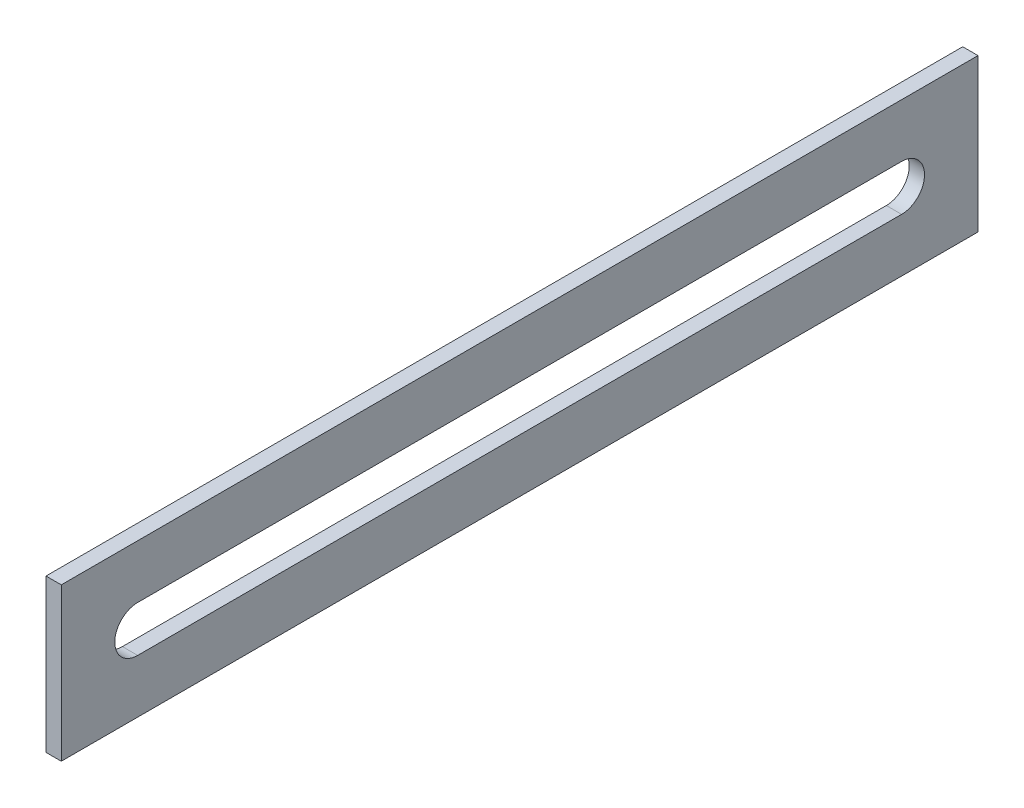
ISO-10303-21;
HEADER;
FILE_DESCRIPTION(('STEP AP214'),'2;1');
FILE_NAME('part.step','',(''),(''),'','','');
FILE_SCHEMA(('AUTOMOTIVE_DESIGN { 1 0 10303 214 1 1 1 1 }'));
ENDSEC;
DATA;
#1=APPLICATION_CONTEXT('core data for automotive mechanical design processes');
#2=APPLICATION_PROTOCOL_DEFINITION('international standard','automotive_design',2000,#1);
#3=PRODUCT_CONTEXT('',#1,'mechanical');
#4=PRODUCT('Part','Part','',(#3));
#5=PRODUCT_RELATED_PRODUCT_CATEGORY('part','',(#4));
#6=PRODUCT_DEFINITION_FORMATION('','',#4);
#7=PRODUCT_DEFINITION_CONTEXT('part definition',#1,'design');
#8=PRODUCT_DEFINITION('design','',#6,#7);
#9=PRODUCT_DEFINITION_SHAPE('','',#8);
#10=(LENGTH_UNIT() NAMED_UNIT(*) SI_UNIT(.MILLI.,.METRE.));
#11=(NAMED_UNIT(*) PLANE_ANGLE_UNIT() SI_UNIT($,.RADIAN.));
#12=(NAMED_UNIT(*) SI_UNIT($,.STERADIAN.) SOLID_ANGLE_UNIT());
#13=UNCERTAINTY_MEASURE_WITH_UNIT(LENGTH_MEASURE(1.E-05),#10,'distance_accuracy_value','');
#14=(GEOMETRIC_REPRESENTATION_CONTEXT(3) GLOBAL_UNCERTAINTY_ASSIGNED_CONTEXT((#13)) GLOBAL_UNIT_ASSIGNED_CONTEXT((#10,
#11,#12)) REPRESENTATION_CONTEXT('',''));
#15=CARTESIAN_POINT('',(0.,0.,0.));
#16=DIRECTION('',(0.,0.,1.));
#17=DIRECTION('',(1.,0.,0.));
#18=AXIS2_PLACEMENT_3D('',#15,#16,#17);
#19=CARTESIAN_POINT('',(1.,0.,0.));
#20=DIRECTION('',(1.,0.,0.));
#21=DIRECTION('',(0.,0.,-1.));
#22=AXIS2_PLACEMENT_3D('',#19,#20,#21);
#23=PLANE('',#22);
#24=DIRECTION('',(0.,-1.,0.));
#25=VECTOR('',#24,1.);
#26=CARTESIAN_POINT('',(1.,9.62195212296734,1.56603773584906));
#27=LINE('',#26,#25);
#28=CARTESIAN_POINT('',(1.,9.62195212296734,1.56603773584906));
#29=VERTEX_POINT('',#28);
#30=CARTESIAN_POINT('',(1.,-0.378047877032661,1.56603773584906));
#31=VERTEX_POINT('',#30);
#32=EDGE_CURVE('E153',#29,#31,#27,.T.);
#33=ORIENTED_EDGE('',*,*,#32,.T.);
#34=DIRECTION('',(0.,0.,-1.));
#35=VECTOR('',#34,1.);
#36=CARTESIAN_POINT('',(1.,-0.378047877032661,1.56603773584906));
#37=LINE('',#36,#35);
#38=CARTESIAN_POINT('',(1.,-0.378047877032661,-58.4339622641509));
#39=VERTEX_POINT('',#38);
#40=EDGE_CURVE('E157',#31,#39,#37,.T.);
#41=ORIENTED_EDGE('',*,*,#40,.T.);
#42=DIRECTION('',(0.,1.,0.));
#43=VECTOR('',#42,1.);
#44=CARTESIAN_POINT('',(1.,9.62195212296734,-58.4339622641509));
#45=LINE('',#44,#43);
#46=CARTESIAN_POINT('',(1.,9.62195212296734,-58.4339622641509));
#47=VERTEX_POINT('',#46);
#48=EDGE_CURVE('E161',#39,#47,#45,.T.);
#49=ORIENTED_EDGE('',*,*,#48,.T.);
#50=DIRECTION('',(0.,0.,1.));
#51=VECTOR('',#50,1.);
#52=CARTESIAN_POINT('',(1.,9.62195212296734,1.56603773584906));
#53=LINE('',#52,#51);
#54=EDGE_CURVE('E164',#47,#29,#53,.T.);
#55=ORIENTED_EDGE('',*,*,#54,.T.);
#56=EDGE_LOOP('',(#33,#41,#49,#55));
#57=FACE_BOUND('',#56,.T.);
#58=DIRECTION('',(0.,0.,-1.));
#59=VECTOR('',#58,1.);
#60=CARTESIAN_POINT('',(1.,3.12195212296734,-3.43396226415094));
#61=LINE('',#60,#59);
#62=CARTESIAN_POINT('',(1.,3.12195212296734,-3.43396226415094));
#63=VERTEX_POINT('',#62);
#64=CARTESIAN_POINT('',(1.,3.12195212296734,-53.4339622641509));
#65=VERTEX_POINT('',#64);
#66=EDGE_CURVE('E114',#63,#65,#61,.T.);
#67=ORIENTED_EDGE('',*,*,#66,.F.);
#68=CARTESIAN_POINT('',(1.,4.62195212296734,-3.43396226415094));
#69=DIRECTION('',(1.,0.,0.));
#70=DIRECTION('',(0.,0.,1.));
#71=AXIS2_PLACEMENT_3D('',#68,#69,#70);
#72=CIRCLE('',#71,1.5);
#73=CARTESIAN_POINT('',(1.,6.12195212296734,-3.43396226415094));
#74=VERTEX_POINT('',#73);
#75=EDGE_CURVE('E105',#74,#63,#72,.T.);
#76=ORIENTED_EDGE('',*,*,#75,.F.);
#77=DIRECTION('',(0.,0.,1.));
#78=VECTOR('',#77,1.);
#79=CARTESIAN_POINT('',(1.,6.12195212296734,-3.43396226415094));
#80=LINE('',#79,#78);
#81=CARTESIAN_POINT('',(1.,6.12195212296734,-53.4339622641509));
#82=VERTEX_POINT('',#81);
#83=EDGE_CURVE('E131',#82,#74,#80,.T.);
#84=ORIENTED_EDGE('',*,*,#83,.F.);
#85=CARTESIAN_POINT('',(1.,4.62195212296734,-53.4339622641509));
#86=DIRECTION('',(1.,0.,0.));
#87=DIRECTION('',(0.,0.,1.));
#88=AXIS2_PLACEMENT_3D('',#85,#86,#87);
#89=CIRCLE('',#88,1.5);
#90=EDGE_CURVE('E127',#65,#82,#89,.T.);
#91=ORIENTED_EDGE('',*,*,#90,.F.);
#92=EDGE_LOOP('',(#67,#76,#84,#91));
#93=FACE_BOUND('',#92,.T.);
#94=ADVANCED_FACE('F39',(#57,#93),#23,.T.);
#95=CARTESIAN_POINT('',(0.,0.,0.));
#96=DIRECTION('',(1.,0.,0.));
#97=DIRECTION('',(0.,0.,-1.));
#98=AXIS2_PLACEMENT_3D('',#95,#96,#97);
#99=PLANE('',#98);
#100=DIRECTION('',(0.,-1.,0.));
#101=VECTOR('',#100,1.);
#102=CARTESIAN_POINT('',(0.,9.62195212296734,1.56603773584906));
#103=LINE('',#102,#101);
#104=CARTESIAN_POINT('',(0.,9.62195212296734,1.56603773584906));
#105=VERTEX_POINT('',#104);
#106=CARTESIAN_POINT('',(0.,-0.378047877032661,1.56603773584906));
#107=VERTEX_POINT('',#106);
#108=EDGE_CURVE('E123',#105,#107,#103,.T.);
#109=ORIENTED_EDGE('',*,*,#108,.F.);
#110=DIRECTION('',(0.,0.,1.));
#111=VECTOR('',#110,1.);
#112=CARTESIAN_POINT('',(0.,9.62195212296734,1.56603773584906));
#113=LINE('',#112,#111);
#114=CARTESIAN_POINT('',(0.,9.62195212296734,-58.4339622641509));
#115=VERTEX_POINT('',#114);
#116=EDGE_CURVE('E158',#115,#105,#113,.T.);
#117=ORIENTED_EDGE('',*,*,#116,.F.);
#118=DIRECTION('',(0.,1.,0.));
#119=VECTOR('',#118,1.);
#120=CARTESIAN_POINT('',(0.,9.62195212296734,-58.4339622641509));
#121=LINE('',#120,#119);
#122=CARTESIAN_POINT('',(0.,-0.378047877032661,-58.4339622641509));
#123=VERTEX_POINT('',#122);
#124=EDGE_CURVE('E174',#123,#115,#121,.T.);
#125=ORIENTED_EDGE('',*,*,#124,.F.);
#126=DIRECTION('',(0.,0.,-1.));
#127=VECTOR('',#126,1.);
#128=CARTESIAN_POINT('',(0.,-0.378047877032661,1.56603773584906));
#129=LINE('',#128,#127);
#130=EDGE_CURVE('E171',#107,#123,#129,.T.);
#131=ORIENTED_EDGE('',*,*,#130,.F.);
#132=EDGE_LOOP('',(#109,#117,#125,#131));
#133=FACE_BOUND('',#132,.T.);
#134=CARTESIAN_POINT('',(0.,4.62195212296734,-3.43396226415094));
#135=DIRECTION('',(1.,0.,0.));
#136=DIRECTION('',(0.,0.,1.));
#137=AXIS2_PLACEMENT_3D('',#134,#135,#136);
#138=CIRCLE('',#137,1.5);
#139=CARTESIAN_POINT('',(0.,6.12195212296734,-3.43396226415094));
#140=VERTEX_POINT('',#139);
#141=CARTESIAN_POINT('',(0.,3.12195212296734,-3.43396226415094));
#142=VERTEX_POINT('',#141);
#143=EDGE_CURVE('E63',#140,#142,#138,.T.);
#144=ORIENTED_EDGE('',*,*,#143,.T.);
#145=DIRECTION('',(0.,0.,-1.));
#146=VECTOR('',#145,1.);
#147=CARTESIAN_POINT('',(0.,3.12195212296734,-3.43396226415094));
#148=LINE('',#147,#146);
#149=CARTESIAN_POINT('',(0.,3.12195212296734,-53.4339622641509));
#150=VERTEX_POINT('',#149);
#151=EDGE_CURVE('E121',#142,#150,#148,.T.);
#152=ORIENTED_EDGE('',*,*,#151,.T.);
#153=CARTESIAN_POINT('',(0.,4.62195212296734,-53.4339622641509));
#154=DIRECTION('',(1.,0.,0.));
#155=DIRECTION('',(0.,0.,1.));
#156=AXIS2_PLACEMENT_3D('',#153,#154,#155);
#157=CIRCLE('',#156,1.5);
#158=CARTESIAN_POINT('',(0.,6.12195212296734,-53.4339622641509));
#159=VERTEX_POINT('',#158);
#160=EDGE_CURVE('E140',#150,#159,#157,.T.);
#161=ORIENTED_EDGE('',*,*,#160,.T.);
#162=DIRECTION('',(0.,0.,1.));
#163=VECTOR('',#162,1.);
#164=CARTESIAN_POINT('',(0.,6.12195212296734,-3.43396226415094));
#165=LINE('',#164,#163);
#166=EDGE_CURVE('E115',#159,#140,#165,.T.);
#167=ORIENTED_EDGE('',*,*,#166,.T.);
#168=EDGE_LOOP('',(#144,#152,#161,#167));
#169=FACE_BOUND('',#168,.T.);
#170=ADVANCED_FACE('F197',(#133,#169),#99,.F.);
#171=CARTESIAN_POINT('',(1.,9.62195212296734,1.56603773584906));
#172=DIRECTION('',(0.,0.,-1.));
#173=DIRECTION('',(0.,1.,0.));
#174=AXIS2_PLACEMENT_3D('',#171,#172,#173);
#175=PLANE('',#174);
#176=ORIENTED_EDGE('',*,*,#108,.T.);
#177=DIRECTION('',(-1.,0.,0.));
#178=VECTOR('',#177,1.);
#179=CARTESIAN_POINT('',(1.,-0.378047877032661,1.56603773584906));
#180=LINE('',#179,#178);
#181=EDGE_CURVE('E11',#31,#107,#180,.T.);
#182=ORIENTED_EDGE('',*,*,#181,.F.);
#183=ORIENTED_EDGE('',*,*,#32,.F.);
#184=DIRECTION('',(-1.,0.,0.));
#185=VECTOR('',#184,1.);
#186=CARTESIAN_POINT('',(1.,9.62195212296734,1.56603773584906));
#187=LINE('',#186,#185);
#188=EDGE_CURVE('E167',#29,#105,#187,.T.);
#189=ORIENTED_EDGE('',*,*,#188,.T.);
#190=EDGE_LOOP('',(#176,#182,#183,#189));
#191=FACE_BOUND('',#190,.T.);
#192=ADVANCED_FACE('F41',(#191),#175,.F.);
#193=CARTESIAN_POINT('',(1.,-0.378047877032661,1.56603773584906));
#194=DIRECTION('',(0.,1.,0.));
#195=DIRECTION('',(0.,0.,1.));
#196=AXIS2_PLACEMENT_3D('',#193,#194,#195);
#197=PLANE('',#196);
#198=ORIENTED_EDGE('',*,*,#130,.T.);
#199=DIRECTION('',(-1.,0.,0.));
#200=VECTOR('',#199,1.);
#201=CARTESIAN_POINT('',(1.,-0.378047877032661,-58.4339622641509));
#202=LINE('',#201,#200);
#203=EDGE_CURVE('E48',#39,#123,#202,.T.);
#204=ORIENTED_EDGE('',*,*,#203,.F.);
#205=ORIENTED_EDGE('',*,*,#40,.F.);
#206=ORIENTED_EDGE('',*,*,#181,.T.);
#207=EDGE_LOOP('',(#198,#204,#205,#206));
#208=FACE_BOUND('',#207,.T.);
#209=ADVANCED_FACE('F207',(#208),#197,.F.);
#210=CARTESIAN_POINT('',(1.,9.62195212296734,-58.4339622641509));
#211=DIRECTION('',(0.,0.,1.));
#212=DIRECTION('',(1.,0.,0.));
#213=AXIS2_PLACEMENT_3D('',#210,#211,#212);
#214=PLANE('',#213);
#215=ORIENTED_EDGE('',*,*,#124,.T.);
#216=DIRECTION('',(-1.,0.,0.));
#217=VECTOR('',#216,1.);
#218=CARTESIAN_POINT('',(1.,9.62195212296734,-58.4339622641509));
#219=LINE('',#218,#217);
#220=EDGE_CURVE('E182',#47,#115,#219,.T.);
#221=ORIENTED_EDGE('',*,*,#220,.F.);
#222=ORIENTED_EDGE('',*,*,#48,.F.);
#223=ORIENTED_EDGE('',*,*,#203,.T.);
#224=EDGE_LOOP('',(#215,#221,#222,#223));
#225=FACE_BOUND('',#224,.T.);
#226=ADVANCED_FACE('F191',(#225),#214,.F.);
#227=CARTESIAN_POINT('',(1.,9.62195212296734,1.56603773584906));
#228=DIRECTION('',(0.,-1.,0.));
#229=DIRECTION('',(0.,0.,-1.));
#230=AXIS2_PLACEMENT_3D('',#227,#228,#229);
#231=PLANE('',#230);
#232=ORIENTED_EDGE('',*,*,#116,.T.);
#233=ORIENTED_EDGE('',*,*,#188,.F.);
#234=ORIENTED_EDGE('',*,*,#54,.F.);
#235=ORIENTED_EDGE('',*,*,#220,.T.);
#236=EDGE_LOOP('',(#232,#233,#234,#235));
#237=FACE_BOUND('',#236,.T.);
#238=ADVANCED_FACE('F201',(#237),#231,.F.);
#239=CARTESIAN_POINT('',(1.,4.62195212296734,-3.43396226415094));
#240=DIRECTION('',(-1.,0.,0.));
#241=DIRECTION('',(0.,0.,1.));
#242=AXIS2_PLACEMENT_3D('',#239,#240,#241);
#243=CYLINDRICAL_SURFACE('',#242,1.5);
#244=ORIENTED_EDGE('',*,*,#143,.F.);
#245=DIRECTION('',(-1.,0.,0.));
#246=VECTOR('',#245,1.);
#247=CARTESIAN_POINT('',(1.,6.12195212296734,-3.43396226415094));
#248=LINE('',#247,#246);
#249=EDGE_CURVE('E109',#74,#140,#248,.T.);
#250=ORIENTED_EDGE('',*,*,#249,.F.);
#251=ORIENTED_EDGE('',*,*,#75,.T.);
#252=DIRECTION('',(-1.,0.,0.));
#253=VECTOR('',#252,1.);
#254=CARTESIAN_POINT('',(1.,3.12195212296734,-3.43396226415094));
#255=LINE('',#254,#253);
#256=EDGE_CURVE('E108',#63,#142,#255,.T.);
#257=ORIENTED_EDGE('',*,*,#256,.T.);
#258=EDGE_LOOP('',(#244,#250,#251,#257));
#259=FACE_BOUND('',#258,.T.);
#260=ADVANCED_FACE('F107',(#259),#243,.F.);
#261=CARTESIAN_POINT('',(1.,3.12195212296734,-3.43396226415094));
#262=DIRECTION('',(0.,1.,0.));
#263=DIRECTION('',(0.,0.,1.));
#264=AXIS2_PLACEMENT_3D('',#261,#262,#263);
#265=PLANE('',#264);
#266=ORIENTED_EDGE('',*,*,#151,.F.);
#267=ORIENTED_EDGE('',*,*,#256,.F.);
#268=ORIENTED_EDGE('',*,*,#66,.T.);
#269=DIRECTION('',(-1.,0.,0.));
#270=VECTOR('',#269,1.);
#271=CARTESIAN_POINT('',(1.,3.12195212296734,-53.4339622641509));
#272=LINE('',#271,#270);
#273=EDGE_CURVE('E124',#65,#150,#272,.T.);
#274=ORIENTED_EDGE('',*,*,#273,.T.);
#275=EDGE_LOOP('',(#266,#267,#268,#274));
#276=FACE_BOUND('',#275,.T.);
#277=ADVANCED_FACE('F118',(#276),#265,.T.);
#278=CARTESIAN_POINT('',(1.,4.62195212296734,-53.4339622641509));
#279=DIRECTION('',(-1.,0.,0.));
#280=DIRECTION('',(0.,0.,1.));
#281=AXIS2_PLACEMENT_3D('',#278,#279,#280);
#282=CYLINDRICAL_SURFACE('',#281,1.5);
#283=ORIENTED_EDGE('',*,*,#160,.F.);
#284=ORIENTED_EDGE('',*,*,#273,.F.);
#285=ORIENTED_EDGE('',*,*,#90,.T.);
#286=DIRECTION('',(-1.,0.,0.));
#287=VECTOR('',#286,1.);
#288=CARTESIAN_POINT('',(1.,6.12195212296734,-53.4339622641509));
#289=LINE('',#288,#287);
#290=EDGE_CURVE('E55',#82,#159,#289,.T.);
#291=ORIENTED_EDGE('',*,*,#290,.T.);
#292=EDGE_LOOP('',(#283,#284,#285,#291));
#293=FACE_BOUND('',#292,.T.);
#294=ADVANCED_FACE('F230',(#293),#282,.F.);
#295=CARTESIAN_POINT('',(1.,6.12195212296734,-3.43396226415094));
#296=DIRECTION('',(0.,-1.,0.));
#297=DIRECTION('',(0.,0.,-1.));
#298=AXIS2_PLACEMENT_3D('',#295,#296,#297);
#299=PLANE('',#298);
#300=ORIENTED_EDGE('',*,*,#166,.F.);
#301=ORIENTED_EDGE('',*,*,#290,.F.);
#302=ORIENTED_EDGE('',*,*,#83,.T.);
#303=ORIENTED_EDGE('',*,*,#249,.T.);
#304=EDGE_LOOP('',(#300,#301,#302,#303));
#305=FACE_BOUND('',#304,.T.);
#306=ADVANCED_FACE('F234',(#305),#299,.T.);
#307=CLOSED_SHELL('',(#94,#170,#192,#209,#226,#238,#260,#277,#294,#306));
#308=MANIFOLD_SOLID_BREP('B2',#307);
#309=ADVANCED_BREP_SHAPE_REPRESENTATION('',(#18,#308),#14);
#310=SHAPE_DEFINITION_REPRESENTATION(#9,#309);
ENDSEC;
END-ISO-10303-21;
